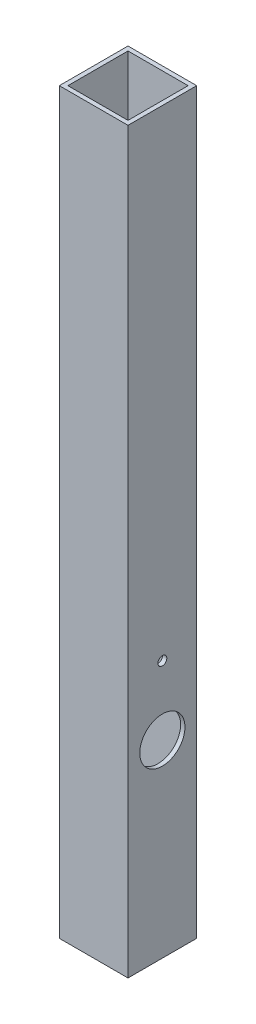
ISO-10303-21;
HEADER;
FILE_DESCRIPTION(('STEP AP214'),'2;1');
FILE_NAME('part.step','',(''),(''),'','','');
FILE_SCHEMA(('AUTOMOTIVE_DESIGN { 1 0 10303 214 1 1 1 1 }'));
ENDSEC;
DATA;
#1=APPLICATION_CONTEXT('core data for automotive mechanical design processes');
#2=APPLICATION_PROTOCOL_DEFINITION('international standard','automotive_design',2000,#1);
#3=PRODUCT_CONTEXT('',#1,'mechanical');
#4=PRODUCT('Part','Part','',(#3));
#5=PRODUCT_RELATED_PRODUCT_CATEGORY('part','',(#4));
#6=PRODUCT_DEFINITION_FORMATION('','',#4);
#7=PRODUCT_DEFINITION_CONTEXT('part definition',#1,'design');
#8=PRODUCT_DEFINITION('design','',#6,#7);
#9=PRODUCT_DEFINITION_SHAPE('','',#8);
#10=(LENGTH_UNIT() NAMED_UNIT(*) SI_UNIT(.MILLI.,.METRE.));
#11=(NAMED_UNIT(*) PLANE_ANGLE_UNIT() SI_UNIT($,.RADIAN.));
#12=(NAMED_UNIT(*) SI_UNIT($,.STERADIAN.) SOLID_ANGLE_UNIT());
#13=UNCERTAINTY_MEASURE_WITH_UNIT(LENGTH_MEASURE(1.E-05),#10,'distance_accuracy_value','');
#14=(GEOMETRIC_REPRESENTATION_CONTEXT(3) GLOBAL_UNCERTAINTY_ASSIGNED_CONTEXT((#13)) GLOBAL_UNIT_ASSIGNED_CONTEXT((#10,
#11,#12)) REPRESENTATION_CONTEXT('',''));
#15=CARTESIAN_POINT('',(0.,0.,0.));
#16=DIRECTION('',(0.,0.,1.));
#17=DIRECTION('',(1.,0.,0.));
#18=AXIS2_PLACEMENT_3D('',#15,#16,#17);
#19=CARTESIAN_POINT('',(50.8,-273.05,25.4000000000001));
#20=DIRECTION('',(0.,0.,-1.));
#21=DIRECTION('',(-1.,0.,0.));
#22=AXIS2_PLACEMENT_3D('',#19,#20,#21);
#23=PLANE('',#22);
#24=DIRECTION('',(0.,-0.999999999999999,0.));
#25=VECTOR('',#24,1.);
#26=CARTESIAN_POINT('',(0.,-273.05,25.4000000000001));
#27=LINE('',#26,#25);
#28=CARTESIAN_POINT('',(0.,273.05,25.4000000000001));
#29=VERTEX_POINT('',#28);
#30=CARTESIAN_POINT('',(0.,-273.05,25.4000000000001));
#31=VERTEX_POINT('',#30);
#32=EDGE_CURVE('E136',#29,#31,#27,.T.);
#33=ORIENTED_EDGE('',*,*,#32,.T.);
#34=DIRECTION('',(-1.,0.,0.));
#35=VECTOR('',#34,1.);
#36=CARTESIAN_POINT('',(50.8,-273.05,25.4000000000001));
#37=LINE('',#36,#35);
#38=CARTESIAN_POINT('',(50.8,-273.05,25.4000000000001));
#39=VERTEX_POINT('',#38);
#40=EDGE_CURVE('E11',#39,#31,#37,.T.);
#41=ORIENTED_EDGE('',*,*,#40,.F.);
#42=DIRECTION('',(0.,-0.999999999999999,0.));
#43=VECTOR('',#42,1.);
#44=CARTESIAN_POINT('',(50.8,-273.05,25.4000000000001));
#45=LINE('',#44,#43);
#46=CARTESIAN_POINT('',(50.8,273.05,25.4000000000001));
#47=VERTEX_POINT('',#46);
#48=EDGE_CURVE('E140',#47,#39,#45,.T.);
#49=ORIENTED_EDGE('',*,*,#48,.F.);
#50=DIRECTION('',(-1.,0.,0.));
#51=VECTOR('',#50,1.);
#52=CARTESIAN_POINT('',(50.8,273.05,25.4000000000001));
#53=LINE('',#52,#51);
#54=EDGE_CURVE('E150',#47,#29,#53,.T.);
#55=ORIENTED_EDGE('',*,*,#54,.T.);
#56=EDGE_LOOP('',(#33,#41,#49,#55));
#57=FACE_BOUND('',#56,.T.);
#58=ADVANCED_FACE('F34',(#57),#23,.F.);
#59=CARTESIAN_POINT('',(50.8,-273.05,-25.4000000000001));
#60=DIRECTION('',(0.,0.999999999999999,0.));
#61=DIRECTION('',(0.,0.,1.));
#62=AXIS2_PLACEMENT_3D('',#59,#60,#61);
#63=PLANE('',#62);
#64=DIRECTION('',(0.,0.,-1.));
#65=VECTOR('',#64,1.);
#66=CARTESIAN_POINT('',(47.625,-273.05,22.2249999999999));
#67=LINE('',#66,#65);
#68=CARTESIAN_POINT('',(47.625,-273.05,22.2249999999999));
#69=VERTEX_POINT('',#68);
#70=CARTESIAN_POINT('',(47.625,-273.05,-22.2249999999999));
#71=VERTEX_POINT('',#70);
#72=EDGE_CURVE('E108',#69,#71,#67,.T.);
#73=ORIENTED_EDGE('',*,*,#72,.T.);
#74=DIRECTION('',(-1.,0.,0.));
#75=VECTOR('',#74,1.);
#76=CARTESIAN_POINT('',(47.625,-273.05,-22.2249999999999));
#77=LINE('',#76,#75);
#78=CARTESIAN_POINT('',(3.17499999999993,-273.05,-22.2249999999999));
#79=VERTEX_POINT('',#78);
#80=EDGE_CURVE('E102',#71,#79,#77,.T.);
#81=ORIENTED_EDGE('',*,*,#80,.T.);
#82=DIRECTION('',(0.,0.,1.));
#83=VECTOR('',#82,1.);
#84=CARTESIAN_POINT('',(3.17499999999993,-273.05,-22.2249999999999));
#85=LINE('',#84,#83);
#86=CARTESIAN_POINT('',(3.17499999999993,-273.05,22.2249999999999));
#87=VERTEX_POINT('',#86);
#88=EDGE_CURVE('E111',#79,#87,#85,.T.);
#89=ORIENTED_EDGE('',*,*,#88,.T.);
#90=DIRECTION('',(1.,0.,0.));
#91=VECTOR('',#90,1.);
#92=CARTESIAN_POINT('',(3.17499999999993,-273.05,22.2249999999999));
#93=LINE('',#92,#91);
#94=EDGE_CURVE('E50',#87,#69,#93,.T.);
#95=ORIENTED_EDGE('',*,*,#94,.T.);
#96=EDGE_LOOP('',(#73,#81,#89,#95));
#97=FACE_BOUND('',#96,.T.);
#98=DIRECTION('',(0.,0.,-1.));
#99=VECTOR('',#98,1.);
#100=CARTESIAN_POINT('',(0.,-273.05,-25.4000000000001));
#101=LINE('',#100,#99);
#102=CARTESIAN_POINT('',(0.,-273.05,-25.4000000000001));
#103=VERTEX_POINT('',#102);
#104=EDGE_CURVE('E153',#31,#103,#101,.T.);
#105=ORIENTED_EDGE('',*,*,#104,.T.);
#106=DIRECTION('',(-1.,0.,0.));
#107=VECTOR('',#106,1.);
#108=CARTESIAN_POINT('',(50.8,-273.05,-25.4000000000001));
#109=LINE('',#108,#107);
#110=CARTESIAN_POINT('',(50.8,-273.05,-25.4000000000001));
#111=VERTEX_POINT('',#110);
#112=EDGE_CURVE('E42',#111,#103,#109,.T.);
#113=ORIENTED_EDGE('',*,*,#112,.F.);
#114=DIRECTION('',(0.,0.,-1.));
#115=VECTOR('',#114,1.);
#116=CARTESIAN_POINT('',(50.8,-273.05,-25.4000000000001));
#117=LINE('',#116,#115);
#118=EDGE_CURVE('E143',#39,#111,#117,.T.);
#119=ORIENTED_EDGE('',*,*,#118,.F.);
#120=ORIENTED_EDGE('',*,*,#40,.T.);
#121=EDGE_LOOP('',(#105,#113,#119,#120));
#122=FACE_BOUND('',#121,.T.);
#123=ADVANCED_FACE('F115',(#97,#122),#63,.F.);
#124=CARTESIAN_POINT('',(50.8,-273.05,-25.4000000000001));
#125=DIRECTION('',(0.,0.,1.));
#126=DIRECTION('',(1.,0.,0.));
#127=AXIS2_PLACEMENT_3D('',#124,#125,#126);
#128=PLANE('',#127);
#129=DIRECTION('',(0.,0.999999999999999,0.));
#130=VECTOR('',#129,1.);
#131=CARTESIAN_POINT('',(0.,-273.05,-25.4000000000001));
#132=LINE('',#131,#130);
#133=CARTESIAN_POINT('',(0.,273.05,-25.4000000000001));
#134=VERTEX_POINT('',#133);
#135=EDGE_CURVE('E155',#103,#134,#132,.T.);
#136=ORIENTED_EDGE('',*,*,#135,.T.);
#137=DIRECTION('',(-1.,0.,0.));
#138=VECTOR('',#137,1.);
#139=CARTESIAN_POINT('',(50.8,273.05,-25.4000000000001));
#140=LINE('',#139,#138);
#141=CARTESIAN_POINT('',(50.8,273.05,-25.4000000000001));
#142=VERTEX_POINT('',#141);
#143=EDGE_CURVE('E160',#142,#134,#140,.T.);
#144=ORIENTED_EDGE('',*,*,#143,.F.);
#145=DIRECTION('',(0.,0.999999999999999,0.));
#146=VECTOR('',#145,1.);
#147=CARTESIAN_POINT('',(50.8,-273.05,-25.4000000000001));
#148=LINE('',#147,#146);
#149=EDGE_CURVE('E146',#111,#142,#148,.T.);
#150=ORIENTED_EDGE('',*,*,#149,.F.);
#151=ORIENTED_EDGE('',*,*,#112,.T.);
#152=EDGE_LOOP('',(#136,#144,#150,#151));
#153=FACE_BOUND('',#152,.T.);
#154=ADVANCED_FACE('F207',(#153),#128,.F.);
#155=CARTESIAN_POINT('',(50.8,273.05,-25.4000000000001));
#156=DIRECTION('',(0.,-0.999999999999999,0.));
#157=DIRECTION('',(0.,0.,-1.));
#158=AXIS2_PLACEMENT_3D('',#155,#156,#157);
#159=PLANE('',#158);
#160=DIRECTION('',(0.,0.,1.));
#161=VECTOR('',#160,1.);
#162=CARTESIAN_POINT('',(3.17499999999993,273.05,-22.2249999999999));
#163=LINE('',#162,#161);
#164=CARTESIAN_POINT('',(3.17499999999993,273.05,-22.2249999999999));
#165=VERTEX_POINT('',#164);
#166=CARTESIAN_POINT('',(3.17499999999993,273.05,22.2249999999999));
#167=VERTEX_POINT('',#166);
#168=EDGE_CURVE('E130',#165,#167,#163,.T.);
#169=ORIENTED_EDGE('',*,*,#168,.F.);
#170=DIRECTION('',(-1.,0.,0.));
#171=VECTOR('',#170,1.);
#172=CARTESIAN_POINT('',(47.625,273.05,-22.2249999999999));
#173=LINE('',#172,#171);
#174=CARTESIAN_POINT('',(47.625,273.05,-22.2249999999999));
#175=VERTEX_POINT('',#174);
#176=EDGE_CURVE('E58',#175,#165,#173,.T.);
#177=ORIENTED_EDGE('',*,*,#176,.F.);
#178=DIRECTION('',(0.,0.,-1.));
#179=VECTOR('',#178,1.);
#180=CARTESIAN_POINT('',(47.625,273.05,22.2249999999999));
#181=LINE('',#180,#179);
#182=CARTESIAN_POINT('',(47.625,273.05,22.2249999999999));
#183=VERTEX_POINT('',#182);
#184=EDGE_CURVE('E118',#183,#175,#181,.T.);
#185=ORIENTED_EDGE('',*,*,#184,.F.);
#186=DIRECTION('',(1.,0.,0.));
#187=VECTOR('',#186,1.);
#188=CARTESIAN_POINT('',(3.17499999999993,273.05,22.2249999999999));
#189=LINE('',#188,#187);
#190=EDGE_CURVE('E121',#167,#183,#189,.T.);
#191=ORIENTED_EDGE('',*,*,#190,.F.);
#192=EDGE_LOOP('',(#169,#177,#185,#191));
#193=FACE_BOUND('',#192,.T.);
#194=DIRECTION('',(0.,0.,1.));
#195=VECTOR('',#194,1.);
#196=CARTESIAN_POINT('',(0.,273.05,-25.4000000000001));
#197=LINE('',#196,#195);
#198=EDGE_CURVE('E144',#134,#29,#197,.T.);
#199=ORIENTED_EDGE('',*,*,#198,.T.);
#200=ORIENTED_EDGE('',*,*,#54,.F.);
#201=DIRECTION('',(0.,0.,1.));
#202=VECTOR('',#201,1.);
#203=CARTESIAN_POINT('',(50.8,273.05,-25.4000000000001));
#204=LINE('',#203,#202);
#205=EDGE_CURVE('E148',#142,#47,#204,.T.);
#206=ORIENTED_EDGE('',*,*,#205,.F.);
#207=ORIENTED_EDGE('',*,*,#143,.T.);
#208=EDGE_LOOP('',(#199,#200,#206,#207));
#209=FACE_BOUND('',#208,.T.);
#210=ADVANCED_FACE('F193',(#193,#209),#159,.F.);
#211=CARTESIAN_POINT('',(50.8,1.66533453693773E-13,0.));
#212=DIRECTION('',(1.,0.,0.));
#213=DIRECTION('',(0.,0.,-1.));
#214=AXIS2_PLACEMENT_3D('',#211,#212,#213);
#215=PLANE('',#214);
#216=CARTESIAN_POINT('',(50.8,-133.35,0.));
#217=DIRECTION('',(1.,0.,0.));
#218=DIRECTION('',(0.,0.,-1.));
#219=AXIS2_PLACEMENT_3D('',#216,#217,#218);
#220=CIRCLE('',#219,16.7005);
#221=CARTESIAN_POINT('',(50.8,-133.35,-16.7005));
#222=VERTEX_POINT('',#221);
#223=EDGE_CURVE('E172',#222,#222,#220,.T.);
#224=ORIENTED_EDGE('',*,*,#223,.F.);
#225=EDGE_LOOP('',(#224));
#226=FACE_BOUND('',#225,.T.);
#227=CARTESIAN_POINT('',(50.8,-82.5986404738749,0.));
#228=DIRECTION('',(1.,0.,0.));
#229=DIRECTION('',(0.,0.,-1.));
#230=AXIS2_PLACEMENT_3D('',#227,#228,#229);
#231=CIRCLE('',#230,3.302);
#232=CARTESIAN_POINT('',(50.8,-82.5986404738749,-3.302));
#233=VERTEX_POINT('',#232);
#234=EDGE_CURVE('E182',#233,#233,#231,.T.);
#235=ORIENTED_EDGE('',*,*,#234,.F.);
#236=EDGE_LOOP('',(#235));
#237=FACE_BOUND('',#236,.T.);
#238=ORIENTED_EDGE('',*,*,#48,.T.);
#239=ORIENTED_EDGE('',*,*,#118,.T.);
#240=ORIENTED_EDGE('',*,*,#149,.T.);
#241=ORIENTED_EDGE('',*,*,#205,.T.);
#242=EDGE_LOOP('',(#238,#239,#240,#241));
#243=FACE_BOUND('',#242,.T.);
#244=ADVANCED_FACE('F189',(#226,#237,#243),#215,.T.);
#245=CARTESIAN_POINT('',(0.,0.,0.));
#246=DIRECTION('',(1.,0.,0.));
#247=DIRECTION('',(0.,0.,-1.));
#248=AXIS2_PLACEMENT_3D('',#245,#246,#247);
#249=PLANE('',#248);
#250=CARTESIAN_POINT('',(0.,-133.35,0.));
#251=DIRECTION('',(1.,0.,0.));
#252=DIRECTION('',(0.,0.,-1.));
#253=AXIS2_PLACEMENT_3D('',#250,#251,#252);
#254=CIRCLE('',#253,16.7005);
#255=CARTESIAN_POINT('',(0.,-133.35,-16.7005));
#256=VERTEX_POINT('',#255);
#257=EDGE_CURVE('E167',#256,#256,#254,.T.);
#258=ORIENTED_EDGE('',*,*,#257,.T.);
#259=EDGE_LOOP('',(#258));
#260=FACE_BOUND('',#259,.T.);
#261=CARTESIAN_POINT('',(0.,-82.5986404738751,0.));
#262=DIRECTION('',(1.,0.,0.));
#263=DIRECTION('',(0.,0.,-1.));
#264=AXIS2_PLACEMENT_3D('',#261,#262,#263);
#265=CIRCLE('',#264,3.302);
#266=CARTESIAN_POINT('',(0.,-82.5986404738751,-3.302));
#267=VERTEX_POINT('',#266);
#268=EDGE_CURVE('E177',#267,#267,#265,.T.);
#269=ORIENTED_EDGE('',*,*,#268,.T.);
#270=EDGE_LOOP('',(#269));
#271=FACE_BOUND('',#270,.T.);
#272=ORIENTED_EDGE('',*,*,#32,.F.);
#273=ORIENTED_EDGE('',*,*,#198,.F.);
#274=ORIENTED_EDGE('',*,*,#135,.F.);
#275=ORIENTED_EDGE('',*,*,#104,.F.);
#276=EDGE_LOOP('',(#272,#273,#274,#275));
#277=FACE_BOUND('',#276,.T.);
#278=ADVANCED_FACE('F192',(#260,#271,#277),#249,.F.);
#279=CARTESIAN_POINT('',(47.625,-273.05,-22.2249999999999));
#280=DIRECTION('',(0.,0.,-1.));
#281=DIRECTION('',(-1.,0.,0.));
#282=AXIS2_PLACEMENT_3D('',#279,#280,#281);
#283=PLANE('',#282);
#284=ORIENTED_EDGE('',*,*,#176,.T.);
#285=DIRECTION('',(0.,0.999999999999999,0.));
#286=VECTOR('',#285,1.);
#287=CARTESIAN_POINT('',(3.17499999999993,-273.05,-22.2249999999999));
#288=LINE('',#287,#286);
#289=EDGE_CURVE('E98',#79,#165,#288,.T.);
#290=ORIENTED_EDGE('',*,*,#289,.F.);
#291=ORIENTED_EDGE('',*,*,#80,.F.);
#292=DIRECTION('',(0.,0.999999999999999,0.));
#293=VECTOR('',#292,1.);
#294=CARTESIAN_POINT('',(47.625,-273.05,-22.2249999999999));
#295=LINE('',#294,#293);
#296=EDGE_CURVE('E134',#71,#175,#295,.T.);
#297=ORIENTED_EDGE('',*,*,#296,.T.);
#298=EDGE_LOOP('',(#284,#290,#291,#297));
#299=FACE_BOUND('',#298,.T.);
#300=ADVANCED_FACE('F100',(#299),#283,.F.);
#301=CARTESIAN_POINT('',(47.625,-273.05,22.2249999999999));
#302=DIRECTION('',(1.,0.,0.));
#303=DIRECTION('',(0.,0.,-1.));
#304=AXIS2_PLACEMENT_3D('',#301,#302,#303);
#305=PLANE('',#304);
#306=CARTESIAN_POINT('',(47.6250000000001,-133.35,0.));
#307=DIRECTION('',(1.,0.,0.));
#308=DIRECTION('',(0.,0.,-1.));
#309=AXIS2_PLACEMENT_3D('',#306,#307,#308);
#310=CIRCLE('',#309,16.7005);
#311=CARTESIAN_POINT('',(47.6250000000001,-133.35,-16.7005));
#312=VERTEX_POINT('',#311);
#313=EDGE_CURVE('E124',#312,#312,#310,.T.);
#314=ORIENTED_EDGE('',*,*,#313,.T.);
#315=EDGE_LOOP('',(#314));
#316=FACE_BOUND('',#315,.T.);
#317=CARTESIAN_POINT('',(47.625,-82.5986404738749,0.));
#318=DIRECTION('',(1.,0.,0.));
#319=DIRECTION('',(0.,0.,-1.));
#320=AXIS2_PLACEMENT_3D('',#317,#318,#319);
#321=CIRCLE('',#320,3.302);
#322=CARTESIAN_POINT('',(47.625,-82.5986404738749,-3.302));
#323=VERTEX_POINT('',#322);
#324=EDGE_CURVE('E166',#323,#323,#321,.T.);
#325=ORIENTED_EDGE('',*,*,#324,.T.);
#326=EDGE_LOOP('',(#325));
#327=FACE_BOUND('',#326,.T.);
#328=ORIENTED_EDGE('',*,*,#184,.T.);
#329=ORIENTED_EDGE('',*,*,#296,.F.);
#330=ORIENTED_EDGE('',*,*,#72,.F.);
#331=DIRECTION('',(0.,0.999999999999999,0.));
#332=VECTOR('',#331,1.);
#333=CARTESIAN_POINT('',(47.625,-273.05,22.2249999999999));
#334=LINE('',#333,#332);
#335=EDGE_CURVE('E137',#69,#183,#334,.T.);
#336=ORIENTED_EDGE('',*,*,#335,.T.);
#337=EDGE_LOOP('',(#328,#329,#330,#336));
#338=FACE_BOUND('',#337,.T.);
#339=ADVANCED_FACE('F216',(#316,#327,#338),#305,.F.);
#340=CARTESIAN_POINT('',(3.17499999999993,-273.05,22.2249999999999));
#341=DIRECTION('',(0.,0.,1.));
#342=DIRECTION('',(1.,0.,0.));
#343=AXIS2_PLACEMENT_3D('',#340,#341,#342);
#344=PLANE('',#343);
#345=ORIENTED_EDGE('',*,*,#190,.T.);
#346=ORIENTED_EDGE('',*,*,#335,.F.);
#347=ORIENTED_EDGE('',*,*,#94,.F.);
#348=DIRECTION('',(0.,0.999999999999999,0.));
#349=VECTOR('',#348,1.);
#350=CARTESIAN_POINT('',(3.17499999999993,-273.05,22.2249999999999));
#351=LINE('',#350,#349);
#352=EDGE_CURVE('E107',#87,#167,#351,.T.);
#353=ORIENTED_EDGE('',*,*,#352,.T.);
#354=EDGE_LOOP('',(#345,#346,#347,#353));
#355=FACE_BOUND('',#354,.T.);
#356=ADVANCED_FACE('F234',(#355),#344,.F.);
#357=CARTESIAN_POINT('',(3.17499999999993,-273.05,-22.2249999999999));
#358=DIRECTION('',(-1.,0.,0.));
#359=DIRECTION('',(0.,0.,1.));
#360=AXIS2_PLACEMENT_3D('',#357,#358,#359);
#361=PLANE('',#360);
#362=CARTESIAN_POINT('',(3.17499999999998,-133.35,0.));
#363=DIRECTION('',(-1.,0.,0.));
#364=DIRECTION('',(0.,0.,1.));
#365=AXIS2_PLACEMENT_3D('',#362,#363,#364);
#366=CIRCLE('',#365,16.7005);
#367=CARTESIAN_POINT('',(3.17499999999998,-133.35,16.7005));
#368=VERTEX_POINT('',#367);
#369=EDGE_CURVE('E37',#368,#368,#366,.T.);
#370=ORIENTED_EDGE('',*,*,#369,.T.);
#371=EDGE_LOOP('',(#370));
#372=FACE_BOUND('',#371,.T.);
#373=CARTESIAN_POINT('',(3.17499999999993,-82.5986404738749,0.));
#374=DIRECTION('',(-1.,0.,0.));
#375=DIRECTION('',(0.,0.,1.));
#376=AXIS2_PLACEMENT_3D('',#373,#374,#375);
#377=CIRCLE('',#376,3.302);
#378=CARTESIAN_POINT('',(3.17499999999993,-82.5986404738749,3.302));
#379=VERTEX_POINT('',#378);
#380=EDGE_CURVE('E164',#379,#379,#377,.T.);
#381=ORIENTED_EDGE('',*,*,#380,.T.);
#382=EDGE_LOOP('',(#381));
#383=FACE_BOUND('',#382,.T.);
#384=ORIENTED_EDGE('',*,*,#168,.T.);
#385=ORIENTED_EDGE('',*,*,#352,.F.);
#386=ORIENTED_EDGE('',*,*,#88,.F.);
#387=ORIENTED_EDGE('',*,*,#289,.T.);
#388=EDGE_LOOP('',(#384,#385,#386,#387));
#389=FACE_BOUND('',#388,.T.);
#390=ADVANCED_FACE('F112',(#372,#383,#389),#361,.F.);
#391=CARTESIAN_POINT('',(0.,-82.5986404738751,0.));
#392=DIRECTION('',(1.,0.,0.));
#393=DIRECTION('',(0.,0.,-1.));
#394=AXIS2_PLACEMENT_3D('',#391,#392,#393);
#395=CYLINDRICAL_SURFACE('',#394,3.302);
#396=ORIENTED_EDGE('',*,*,#268,.F.);
#397=EDGE_LOOP('',(#396));
#398=FACE_BOUND('',#397,.T.);
#399=ORIENTED_EDGE('',*,*,#380,.F.);
#400=EDGE_LOOP('',(#399));
#401=FACE_BOUND('',#400,.T.);
#402=ADVANCED_FACE('F249',(#398,#401),#395,.F.);
#403=CARTESIAN_POINT('',(0.,-133.35,0.));
#404=DIRECTION('',(1.,0.,0.));
#405=DIRECTION('',(0.,0.,-1.));
#406=AXIS2_PLACEMENT_3D('',#403,#404,#405);
#407=CYLINDRICAL_SURFACE('',#406,16.7005);
#408=ORIENTED_EDGE('',*,*,#257,.F.);
#409=EDGE_LOOP('',(#408));
#410=FACE_BOUND('',#409,.T.);
#411=ORIENTED_EDGE('',*,*,#369,.F.);
#412=EDGE_LOOP('',(#411));
#413=FACE_BOUND('',#412,.T.);
#414=ADVANCED_FACE('F254',(#410,#413),#407,.F.);
#415=ORIENTED_EDGE('',*,*,#234,.T.);
#416=EDGE_LOOP('',(#415));
#417=FACE_BOUND('',#416,.T.);
#418=ORIENTED_EDGE('',*,*,#324,.F.);
#419=EDGE_LOOP('',(#418));
#420=FACE_BOUND('',#419,.T.);
#421=ADVANCED_FACE('F186',(#417,#420),#395,.F.);
#422=ORIENTED_EDGE('',*,*,#223,.T.);
#423=EDGE_LOOP('',(#422));
#424=FACE_BOUND('',#423,.T.);
#425=ORIENTED_EDGE('',*,*,#313,.F.);
#426=EDGE_LOOP('',(#425));
#427=FACE_BOUND('',#426,.T.);
#428=ADVANCED_FACE('F261',(#424,#427),#407,.F.);
#429=CLOSED_SHELL('',(#58,#123,#154,#210,#244,#278,#300,#339,#356,#390,#402,#414,#421,#428));
#430=MANIFOLD_SOLID_BREP('B2',#429);
#431=ADVANCED_BREP_SHAPE_REPRESENTATION('',(#18,#430),#14);
#432=SHAPE_DEFINITION_REPRESENTATION(#9,#431);
ENDSEC;
END-ISO-10303-21;
